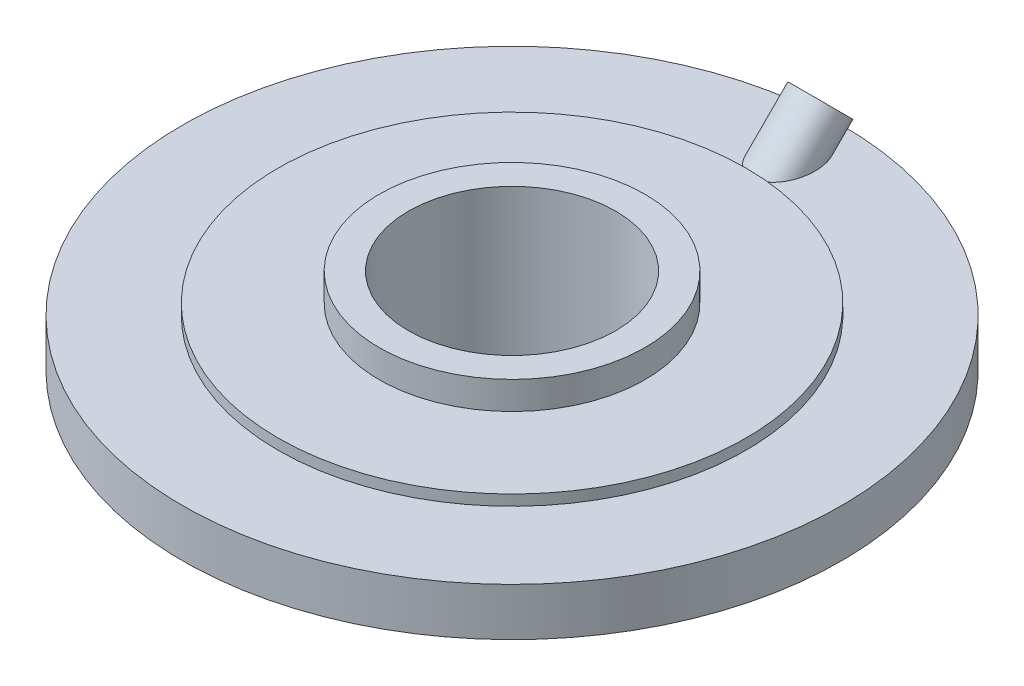
ISO-10303-21;
HEADER;
FILE_DESCRIPTION(('STEP AP214'),'2;1');
FILE_NAME('part.step','',(''),(''),'','','');
FILE_SCHEMA(('AUTOMOTIVE_DESIGN { 1 0 10303 214 1 1 1 1 }'));
ENDSEC;
DATA;
#1=APPLICATION_CONTEXT('core data for automotive mechanical design processes');
#2=APPLICATION_PROTOCOL_DEFINITION('international standard','automotive_design',2000,#1);
#3=PRODUCT_CONTEXT('',#1,'mechanical');
#4=PRODUCT('Part','Part','',(#3));
#5=PRODUCT_RELATED_PRODUCT_CATEGORY('part','',(#4));
#6=PRODUCT_DEFINITION_FORMATION('','',#4);
#7=PRODUCT_DEFINITION_CONTEXT('part definition',#1,'design');
#8=PRODUCT_DEFINITION('design','',#6,#7);
#9=PRODUCT_DEFINITION_SHAPE('','',#8);
#10=(LENGTH_UNIT() NAMED_UNIT(*) SI_UNIT(.MILLI.,.METRE.));
#11=(NAMED_UNIT(*) PLANE_ANGLE_UNIT() SI_UNIT($,.RADIAN.));
#12=(NAMED_UNIT(*) SI_UNIT($,.STERADIAN.) SOLID_ANGLE_UNIT());
#13=UNCERTAINTY_MEASURE_WITH_UNIT(LENGTH_MEASURE(1.E-05),#10,'distance_accuracy_value','');
#14=(GEOMETRIC_REPRESENTATION_CONTEXT(3) GLOBAL_UNCERTAINTY_ASSIGNED_CONTEXT((#13)) GLOBAL_UNIT_ASSIGNED_CONTEXT((#10,
#11,#12)) REPRESENTATION_CONTEXT('',''));
#15=CARTESIAN_POINT('',(0.,0.,0.));
#16=DIRECTION('',(0.,0.,1.));
#17=DIRECTION('',(1.,0.,0.));
#18=AXIS2_PLACEMENT_3D('',#15,#16,#17);
#19=CARTESIAN_POINT('',(0.,0.,0.));
#20=DIRECTION('',(0.,1.,0.));
#21=DIRECTION('',(0.,0.,1.));
#22=AXIS2_PLACEMENT_3D('',#19,#20,#21);
#23=PLANE('',#22);
#24=CARTESIAN_POINT('',(0.,0.,0.));
#25=DIRECTION('',(0.,1.,0.));
#26=DIRECTION('',(0.,0.,1.));
#27=AXIS2_PLACEMENT_3D('',#24,#25,#26);
#28=CIRCLE('',#27,19.5);
#29=CARTESIAN_POINT('',(0.,0.,19.5));
#30=VERTEX_POINT('',#29);
#31=EDGE_CURVE('E52',#30,#30,#28,.T.);
#32=ORIENTED_EDGE('',*,*,#31,.F.);
#33=EDGE_LOOP('',(#32));
#34=FACE_BOUND('',#33,.T.);
#35=CARTESIAN_POINT('',(0.,0.,0.));
#36=DIRECTION('',(0.,-1.,0.));
#37=DIRECTION('',(0.,0.,-1.));
#38=AXIS2_PLACEMENT_3D('',#35,#36,#37);
#39=CIRCLE('',#38,25.);
#40=CARTESIAN_POINT('',(0.,0.,-25.));
#41=VERTEX_POINT('',#40);
#42=EDGE_CURVE('E37',#41,#41,#39,.T.);
#43=ORIENTED_EDGE('',*,*,#42,.F.);
#44=EDGE_LOOP('',(#43));
#45=FACE_BOUND('',#44,.T.);
#46=ADVANCED_FACE('F31',(#34,#45),#23,.T.);
#47=CARTESIAN_POINT('',(0.,-38.0067567567568,0.));
#48=DIRECTION('',(0.,-1.,0.));
#49=DIRECTION('',(0.,0.,-1.));
#50=AXIS2_PLACEMENT_3D('',#47,#48,#49);
#51=CYLINDRICAL_SURFACE('',#50,25.);
#52=ORIENTED_EDGE('',*,*,#42,.T.);
#53=EDGE_LOOP('',(#52));
#54=FACE_BOUND('',#53,.T.);
#55=CARTESIAN_POINT('',(0.,-5.23648648648649,0.));
#56=DIRECTION('',(0.,-1.,0.));
#57=DIRECTION('',(0.,0.,-1.));
#58=AXIS2_PLACEMENT_3D('',#55,#56,#57);
#59=CIRCLE('',#58,25.);
#60=CARTESIAN_POINT('',(0.,-5.23648648648649,-25.));
#61=VERTEX_POINT('',#60);
#62=EDGE_CURVE('E41',#61,#61,#59,.T.);
#63=ORIENTED_EDGE('',*,*,#62,.F.);
#64=EDGE_LOOP('',(#63));
#65=FACE_BOUND('',#64,.T.);
#66=ADVANCED_FACE('F92',(#54,#65),#51,.T.);
#67=CARTESIAN_POINT('',(25.,-5.23648648648649,0.));
#68=DIRECTION('',(0.,1.,0.));
#69=DIRECTION('',(0.,0.,1.));
#70=AXIS2_PLACEMENT_3D('',#67,#68,#69);
#71=PLANE('',#70);
#72=ORIENTED_EDGE('',*,*,#62,.T.);
#73=EDGE_LOOP('',(#72));
#74=FACE_BOUND('',#73,.T.);
#75=CARTESIAN_POINT('',(0.,-5.23648648648649,0.));
#76=DIRECTION('',(0.,-1.,0.));
#77=DIRECTION('',(0.,0.,-1.));
#78=AXIS2_PLACEMENT_3D('',#75,#76,#77);
#79=CIRCLE('',#78,44.);
#80=CARTESIAN_POINT('',(0.,-5.23648648648649,-44.));
#81=VERTEX_POINT('',#80);
#82=EDGE_CURVE('E46',#81,#81,#79,.T.);
#83=ORIENTED_EDGE('',*,*,#82,.F.);
#84=EDGE_LOOP('',(#83));
#85=FACE_BOUND('',#84,.T.);
#86=ADVANCED_FACE('F90',(#74,#85),#71,.T.);
#87=CARTESIAN_POINT('',(0.,-38.0067567567568,0.));
#88=DIRECTION('',(0.,-1.,0.));
#89=DIRECTION('',(0.,0.,-1.));
#90=AXIS2_PLACEMENT_3D('',#87,#88,#89);
#91=CYLINDRICAL_SURFACE('',#90,44.);
#92=ORIENTED_EDGE('',*,*,#82,.T.);
#93=EDGE_LOOP('',(#92));
#94=FACE_BOUND('',#93,.T.);
#95=CARTESIAN_POINT('',(0.,-7.23648648648649,0.));
#96=DIRECTION('',(0.,-1.,0.));
#97=DIRECTION('',(0.,0.,-1.));
#98=AXIS2_PLACEMENT_3D('',#95,#96,#97);
#99=CIRCLE('',#98,44.);
#100=CARTESIAN_POINT('',(0.,-7.23648648648649,-44.));
#101=VERTEX_POINT('',#100);
#102=EDGE_CURVE('E82',#101,#101,#99,.T.);
#103=ORIENTED_EDGE('',*,*,#102,.F.);
#104=EDGE_LOOP('',(#103));
#105=FACE_BOUND('',#104,.T.);
#106=ADVANCED_FACE('F87',(#94,#105),#91,.T.);
#107=CARTESIAN_POINT('',(44.,-7.23648648648649,0.));
#108=DIRECTION('',(0.,1.,0.));
#109=DIRECTION('',(0.,0.,1.));
#110=AXIS2_PLACEMENT_3D('',#107,#108,#109);
#111=PLANE('',#110);
#112=CARTESIAN_POINT('',(0.,-7.23648648648649,-52.));
#113=DIRECTION('',(0.,1.,0.));
#114=DIRECTION('',(0.,0.,-1.));
#115=AXIS2_PLACEMENT_3D('',#112,#113,#114);
#116=ELLIPSE('',#115,7.07106781186551,5.);
#117=CARTESIAN_POINT('',(0.,-7.23648648648649,-59.0710678118655));
#118=VERTEX_POINT('',#117);
#119=EDGE_CURVE('E10',#118,#118,#116,.T.);
#120=ORIENTED_EDGE('',*,*,#119,.F.);
#121=EDGE_LOOP('',(#120));
#122=FACE_BOUND('',#121,.T.);
#123=ORIENTED_EDGE('',*,*,#102,.T.);
#124=EDGE_LOOP('',(#123));
#125=FACE_BOUND('',#124,.T.);
#126=CARTESIAN_POINT('',(0.,-7.23648648648649,0.));
#127=DIRECTION('',(0.,-1.,0.));
#128=DIRECTION('',(0.,0.,-1.));
#129=AXIS2_PLACEMENT_3D('',#126,#127,#128);
#130=CIRCLE('',#129,62.);
#131=CARTESIAN_POINT('',(0.,-7.23648648648649,-62.));
#132=VERTEX_POINT('',#131);
#133=EDGE_CURVE('E79',#132,#132,#130,.T.);
#134=ORIENTED_EDGE('',*,*,#133,.F.);
#135=EDGE_LOOP('',(#134));
#136=FACE_BOUND('',#135,.T.);
#137=ADVANCED_FACE('F99',(#122,#125,#136),#111,.T.);
#138=CARTESIAN_POINT('',(0.,-38.0067567567568,0.));
#139=DIRECTION('',(0.,-1.,0.));
#140=DIRECTION('',(0.,0.,-1.));
#141=AXIS2_PLACEMENT_3D('',#138,#139,#140);
#142=CYLINDRICAL_SURFACE('',#141,62.);
#143=ORIENTED_EDGE('',*,*,#133,.T.);
#144=EDGE_LOOP('',(#143));
#145=FACE_BOUND('',#144,.T.);
#146=CARTESIAN_POINT('',(0.,-16.2364864864865,0.));
#147=DIRECTION('',(0.,-1.,0.));
#148=DIRECTION('',(0.,0.,-1.));
#149=AXIS2_PLACEMENT_3D('',#146,#147,#148);
#150=CIRCLE('',#149,62.);
#151=CARTESIAN_POINT('',(0.,-16.2364864864865,-62.));
#152=VERTEX_POINT('',#151);
#153=EDGE_CURVE('E76',#152,#152,#150,.T.);
#154=ORIENTED_EDGE('',*,*,#153,.F.);
#155=EDGE_LOOP('',(#154));
#156=FACE_BOUND('',#155,.T.);
#157=ADVANCED_FACE('F129',(#145,#156),#142,.T.);
#158=CARTESIAN_POINT('',(62.,-16.2364864864865,0.));
#159=DIRECTION('',(0.,-1.,0.));
#160=DIRECTION('',(0.,0.,-1.));
#161=AXIS2_PLACEMENT_3D('',#158,#159,#160);
#162=PLANE('',#161);
#163=CARTESIAN_POINT('',(0.,-16.2364864864865,-42.9999999999999));
#164=DIRECTION('',(0.,-1.,0.));
#165=DIRECTION('',(0.,0.,-1.));
#166=AXIS2_PLACEMENT_3D('',#163,#164,#165);
#167=ELLIPSE('',#166,2.12132034355965,1.5);
#168=CARTESIAN_POINT('',(0.,-16.2364864864865,-45.1213203435595));
#169=VERTEX_POINT('',#168);
#170=EDGE_CURVE('E64',#169,#169,#167,.T.);
#171=ORIENTED_EDGE('',*,*,#170,.F.);
#172=EDGE_LOOP('',(#171));
#173=FACE_BOUND('',#172,.T.);
#174=ORIENTED_EDGE('',*,*,#153,.T.);
#175=EDGE_LOOP('',(#174));
#176=FACE_BOUND('',#175,.T.);
#177=CARTESIAN_POINT('',(0.,-16.2364864864865,0.));
#178=DIRECTION('',(0.,-1.,0.));
#179=DIRECTION('',(0.,0.,-1.));
#180=AXIS2_PLACEMENT_3D('',#177,#178,#179);
#181=CIRCLE('',#180,30.5);
#182=CARTESIAN_POINT('',(0.,-16.2364864864865,-30.5));
#183=VERTEX_POINT('',#182);
#184=EDGE_CURVE('E73',#183,#183,#181,.T.);
#185=ORIENTED_EDGE('',*,*,#184,.F.);
#186=EDGE_LOOP('',(#185));
#187=FACE_BOUND('',#186,.T.);
#188=ADVANCED_FACE('F134',(#173,#176,#187),#162,.T.);
#189=CARTESIAN_POINT('',(0.,-38.0067567567568,0.));
#190=DIRECTION('',(0.,-1.,0.));
#191=DIRECTION('',(0.,0.,-1.));
#192=AXIS2_PLACEMENT_3D('',#189,#190,#191);
#193=CYLINDRICAL_SURFACE('',#192,30.5);
#194=ORIENTED_EDGE('',*,*,#184,.T.);
#195=EDGE_LOOP('',(#194));
#196=FACE_BOUND('',#195,.T.);
#197=CARTESIAN_POINT('',(0.,-19.2364864864865,0.));
#198=DIRECTION('',(0.,-1.,0.));
#199=DIRECTION('',(0.,0.,-1.));
#200=AXIS2_PLACEMENT_3D('',#197,#198,#199);
#201=CIRCLE('',#200,30.5);
#202=CARTESIAN_POINT('',(0.,-19.2364864864865,-30.5));
#203=VERTEX_POINT('',#202);
#204=EDGE_CURVE('E70',#203,#203,#201,.T.);
#205=ORIENTED_EDGE('',*,*,#204,.F.);
#206=EDGE_LOOP('',(#205));
#207=FACE_BOUND('',#206,.T.);
#208=ADVANCED_FACE('F142',(#196,#207),#193,.T.);
#209=CARTESIAN_POINT('',(30.5,-19.2364864864865,0.));
#210=DIRECTION('',(0.,-1.,0.));
#211=DIRECTION('',(0.,0.,-1.));
#212=AXIS2_PLACEMENT_3D('',#209,#210,#211);
#213=PLANE('',#212);
#214=ORIENTED_EDGE('',*,*,#204,.T.);
#215=EDGE_LOOP('',(#214));
#216=FACE_BOUND('',#215,.T.);
#217=CARTESIAN_POINT('',(0.,-19.2364864864865,0.));
#218=DIRECTION('',(0.,-1.,0.));
#219=DIRECTION('',(0.,0.,-1.));
#220=AXIS2_PLACEMENT_3D('',#217,#218,#219);
#221=CIRCLE('',#220,26.);
#222=CARTESIAN_POINT('',(0.,-19.2364864864865,-26.));
#223=VERTEX_POINT('',#222);
#224=EDGE_CURVE('E56',#223,#223,#221,.T.);
#225=ORIENTED_EDGE('',*,*,#224,.F.);
#226=EDGE_LOOP('',(#225));
#227=FACE_BOUND('',#226,.T.);
#228=ADVANCED_FACE('F147',(#216,#227),#213,.T.);
#229=CARTESIAN_POINT('',(0.,-38.0067567567568,0.));
#230=DIRECTION('',(0.,-1.,0.));
#231=DIRECTION('',(0.,0.,-1.));
#232=AXIS2_PLACEMENT_3D('',#229,#230,#231);
#233=CYLINDRICAL_SURFACE('',#232,26.);
#234=ORIENTED_EDGE('',*,*,#224,.T.);
#235=EDGE_LOOP('',(#234));
#236=FACE_BOUND('',#235,.T.);
#237=CARTESIAN_POINT('',(0.,-38.0067567567568,0.));
#238=DIRECTION('',(0.,-1.,0.));
#239=DIRECTION('',(0.,0.,-1.));
#240=AXIS2_PLACEMENT_3D('',#237,#238,#239);
#241=CIRCLE('',#240,26.);
#242=CARTESIAN_POINT('',(0.,-38.0067567567568,-26.));
#243=VERTEX_POINT('',#242);
#244=EDGE_CURVE('E51',#243,#243,#241,.T.);
#245=ORIENTED_EDGE('',*,*,#244,.F.);
#246=EDGE_LOOP('',(#245));
#247=FACE_BOUND('',#246,.T.);
#248=ADVANCED_FACE('F156',(#236,#247),#233,.T.);
#249=CARTESIAN_POINT('',(26.,-38.0067567567568,0.));
#250=DIRECTION('',(0.,-1.,0.));
#251=DIRECTION('',(0.,0.,-1.));
#252=AXIS2_PLACEMENT_3D('',#249,#250,#251);
#253=PLANE('',#252);
#254=CARTESIAN_POINT('',(0.,-38.0067567567568,0.));
#255=DIRECTION('',(0.,-1.,0.));
#256=DIRECTION('',(0.,0.,-1.));
#257=AXIS2_PLACEMENT_3D('',#254,#255,#256);
#258=CIRCLE('',#257,19.5);
#259=CARTESIAN_POINT('',(0.,-38.0067567567568,-19.5));
#260=VERTEX_POINT('',#259);
#261=EDGE_CURVE('E49',#260,#260,#258,.T.);
#262=ORIENTED_EDGE('',*,*,#261,.F.);
#263=EDGE_LOOP('',(#262));
#264=FACE_BOUND('',#263,.T.);
#265=ORIENTED_EDGE('',*,*,#244,.T.);
#266=EDGE_LOOP('',(#265));
#267=FACE_BOUND('',#266,.T.);
#268=ADVANCED_FACE('F165',(#264,#267),#253,.T.);
#269=CARTESIAN_POINT('',(0.,-90.,0.));
#270=DIRECTION('',(0.,1.,0.));
#271=DIRECTION('',(0.,0.,1.));
#272=AXIS2_PLACEMENT_3D('',#269,#270,#271);
#273=CYLINDRICAL_SURFACE('',#272,19.5);
#274=ORIENTED_EDGE('',*,*,#261,.T.);
#275=EDGE_LOOP('',(#274));
#276=FACE_BOUND('',#275,.T.);
#277=ORIENTED_EDGE('',*,*,#31,.T.);
#278=EDGE_LOOP('',(#277));
#279=FACE_BOUND('',#278,.T.);
#280=ADVANCED_FACE('F175',(#276,#279),#273,.F.);
#281=CARTESIAN_POINT('',(0.,-19.3075542983519,-39.9289321881344));
#282=DIRECTION('',(0.,0.707106781186544,-0.707106781186551));
#283=DIRECTION('',(0.,0.707106781186551,0.707106781186544));
#284=AXIS2_PLACEMENT_3D('',#281,#282,#283);
#285=CYLINDRICAL_SURFACE('',#284,5.);
#286=ORIENTED_EDGE('',*,*,#119,.T.);
#287=EDGE_LOOP('',(#286));
#288=FACE_BOUND('',#287,.T.);
#289=CARTESIAN_POINT('',(0.,-1.23648648648649,-58.));
#290=DIRECTION('',(0.,0.707106781186544,-0.707106781186551));
#291=DIRECTION('',(0.,0.707106781186551,0.707106781186544));
#292=AXIS2_PLACEMENT_3D('',#289,#290,#291);
#293=CIRCLE('',#292,5.);
#294=CARTESIAN_POINT('',(0.,2.29904741944627,-54.4644660940673));
#295=VERTEX_POINT('',#294);
#296=EDGE_CURVE('E59',#295,#295,#293,.T.);
#297=ORIENTED_EDGE('',*,*,#296,.F.);
#298=EDGE_LOOP('',(#297));
#299=FACE_BOUND('',#298,.T.);
#300=ADVANCED_FACE('F182',(#288,#299),#285,.T.);
#301=CARTESIAN_POINT('',(0.,-1.23648648648649,-58.));
#302=DIRECTION('',(0.,0.707106781186544,-0.707106781186551));
#303=DIRECTION('',(0.,0.707106781186551,0.707106781186544));
#304=AXIS2_PLACEMENT_3D('',#301,#302,#303);
#305=PLANE('',#304);
#306=CARTESIAN_POINT('',(0.,-1.23648648648649,-58.));
#307=DIRECTION('',(0.,0.707106781186544,-0.707106781186551));
#308=DIRECTION('',(0.,0.707106781186551,0.707106781186544));
#309=AXIS2_PLACEMENT_3D('',#306,#307,#308);
#310=CIRCLE('',#309,1.5);
#311=CARTESIAN_POINT('',(0.,-0.175826314706662,-56.9393398282202));
#312=VERTEX_POINT('',#311);
#313=EDGE_CURVE('E247',#312,#312,#310,.T.);
#314=ORIENTED_EDGE('',*,*,#313,.F.);
#315=EDGE_LOOP('',(#314));
#316=FACE_BOUND('',#315,.T.);
#317=ORIENTED_EDGE('',*,*,#296,.T.);
#318=EDGE_LOOP('',(#317));
#319=FACE_BOUND('',#318,.T.);
#320=ADVANCED_FACE('F190',(#316,#319),#305,.T.);
#321=CARTESIAN_POINT('',(0.,-21.0354763597097,-38.2010101267766));
#322=DIRECTION('',(0.,0.707106781186544,-0.707106781186551));
#323=DIRECTION('',(0.,0.707106781186551,0.707106781186544));
#324=AXIS2_PLACEMENT_3D('',#321,#322,#323);
#325=CYLINDRICAL_SURFACE('',#324,1.5);
#326=ORIENTED_EDGE('',*,*,#170,.T.);
#327=EDGE_LOOP('',(#326));
#328=FACE_BOUND('',#327,.T.);
#329=ORIENTED_EDGE('',*,*,#313,.T.);
#330=EDGE_LOOP('',(#329));
#331=FACE_BOUND('',#330,.T.);
#332=ADVANCED_FACE('F198',(#328,#331),#325,.F.);
#333=CLOSED_SHELL('',(#46,#66,#86,#106,#137,#157,#188,#208,#228,#248,#268,#280,#300,#320,#332));
#334=MANIFOLD_SOLID_BREP('B2',#333);
#335=ADVANCED_BREP_SHAPE_REPRESENTATION('',(#18,#334),#14);
#336=SHAPE_DEFINITION_REPRESENTATION(#9,#335);
ENDSEC;
END-ISO-10303-21;
